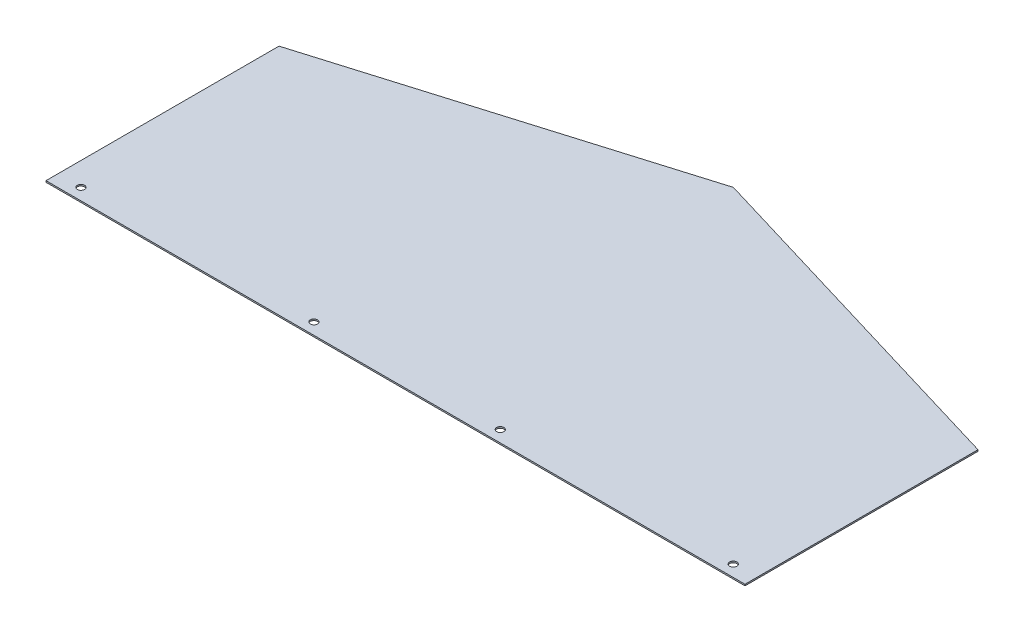
ISO-10303-21;
HEADER;
FILE_DESCRIPTION(('STEP AP214'),'2;1');
FILE_NAME('part.step','',(''),(''),'','','');
FILE_SCHEMA(('AUTOMOTIVE_DESIGN { 1 0 10303 214 1 1 1 1 }'));
ENDSEC;
DATA;
#1=APPLICATION_CONTEXT('core data for automotive mechanical design processes');
#2=APPLICATION_PROTOCOL_DEFINITION('international standard','automotive_design',2000,#1);
#3=PRODUCT_CONTEXT('',#1,'mechanical');
#4=PRODUCT('Part','Part','',(#3));
#5=PRODUCT_RELATED_PRODUCT_CATEGORY('part','',(#4));
#6=PRODUCT_DEFINITION_FORMATION('','',#4);
#7=PRODUCT_DEFINITION_CONTEXT('part definition',#1,'design');
#8=PRODUCT_DEFINITION('design','',#6,#7);
#9=PRODUCT_DEFINITION_SHAPE('','',#8);
#10=(LENGTH_UNIT() NAMED_UNIT(*) SI_UNIT(.MILLI.,.METRE.));
#11=(NAMED_UNIT(*) PLANE_ANGLE_UNIT() SI_UNIT($,.RADIAN.));
#12=(NAMED_UNIT(*) SI_UNIT($,.STERADIAN.) SOLID_ANGLE_UNIT());
#13=UNCERTAINTY_MEASURE_WITH_UNIT(LENGTH_MEASURE(1.E-05),#10,'distance_accuracy_value','');
#14=(GEOMETRIC_REPRESENTATION_CONTEXT(3) GLOBAL_UNCERTAINTY_ASSIGNED_CONTEXT((#13)) GLOBAL_UNIT_ASSIGNED_CONTEXT((#10,
#11,#12)) REPRESENTATION_CONTEXT('',''));
#15=CARTESIAN_POINT('',(0.,0.,0.));
#16=DIRECTION('',(0.,0.,1.));
#17=DIRECTION('',(1.,0.,0.));
#18=AXIS2_PLACEMENT_3D('',#15,#16,#17);
#19=CARTESIAN_POINT('',(0.,3.175,0.));
#20=DIRECTION('',(1.,0.,0.));
#21=DIRECTION('',(0.,0.,-1.));
#22=AXIS2_PLACEMENT_3D('',#19,#20,#21);
#23=PLANE('',#22);
#24=DIRECTION('',(0.,0.,1.));
#25=VECTOR('',#24,1.);
#26=CARTESIAN_POINT('',(0.,0.,0.));
#27=LINE('',#26,#25);
#28=CARTESIAN_POINT('',(-1.24424114793371E-13,0.,-508.));
#29=VERTEX_POINT('',#28);
#30=CARTESIAN_POINT('',(0.,0.,0.));
#31=VERTEX_POINT('',#30);
#32=EDGE_CURVE('E108',#29,#31,#27,.T.);
#33=ORIENTED_EDGE('',*,*,#32,.T.);
#34=DIRECTION('',(0.,-1.,0.));
#35=VECTOR('',#34,1.);
#36=CARTESIAN_POINT('',(0.,3.175,0.));
#37=LINE('',#36,#35);
#38=CARTESIAN_POINT('',(0.,3.175,0.));
#39=VERTEX_POINT('',#38);
#40=EDGE_CURVE('E11',#39,#31,#37,.T.);
#41=ORIENTED_EDGE('',*,*,#40,.F.);
#42=DIRECTION('',(0.,0.,1.));
#43=VECTOR('',#42,1.);
#44=CARTESIAN_POINT('',(0.,3.175,0.));
#45=LINE('',#44,#43);
#46=CARTESIAN_POINT('',(-1.24424114793371E-13,3.175,-508.));
#47=VERTEX_POINT('',#46);
#48=EDGE_CURVE('E117',#47,#39,#45,.T.);
#49=ORIENTED_EDGE('',*,*,#48,.F.);
#50=DIRECTION('',(0.,-1.,0.));
#51=VECTOR('',#50,1.);
#52=CARTESIAN_POINT('',(-1.24424114793371E-13,3.175,-508.));
#53=LINE('',#52,#51);
#54=EDGE_CURVE('E104',#47,#29,#53,.T.);
#55=ORIENTED_EDGE('',*,*,#54,.T.);
#56=EDGE_LOOP('',(#33,#41,#49,#55));
#57=FACE_BOUND('',#56,.T.);
#58=ADVANCED_FACE('F34',(#57),#23,.F.);
#59=CARTESIAN_POINT('',(0.,3.175,0.));
#60=DIRECTION('',(0.,0.,-1.));
#61=DIRECTION('',(-1.,0.,0.));
#62=AXIS2_PLACEMENT_3D('',#59,#60,#61);
#63=PLANE('',#62);
#64=DIRECTION('',(1.,0.,0.));
#65=VECTOR('',#64,1.);
#66=CARTESIAN_POINT('',(0.,0.,0.));
#67=LINE('',#66,#65);
#68=CARTESIAN_POINT('',(1524.,0.,0.));
#69=VERTEX_POINT('',#68);
#70=EDGE_CURVE('E111',#31,#69,#67,.T.);
#71=ORIENTED_EDGE('',*,*,#70,.T.);
#72=DIRECTION('',(0.,-1.,0.));
#73=VECTOR('',#72,1.);
#74=CARTESIAN_POINT('',(1524.,3.175,0.));
#75=LINE('',#74,#73);
#76=CARTESIAN_POINT('',(1524.,3.175,0.));
#77=VERTEX_POINT('',#76);
#78=EDGE_CURVE('E42',#77,#69,#75,.T.);
#79=ORIENTED_EDGE('',*,*,#78,.F.);
#80=DIRECTION('',(1.,0.,0.));
#81=VECTOR('',#80,1.);
#82=CARTESIAN_POINT('',(0.,3.175,0.));
#83=LINE('',#82,#81);
#84=EDGE_CURVE('E84',#39,#77,#83,.T.);
#85=ORIENTED_EDGE('',*,*,#84,.F.);
#86=ORIENTED_EDGE('',*,*,#40,.T.);
#87=EDGE_LOOP('',(#71,#79,#85,#86));
#88=FACE_BOUND('',#87,.T.);
#89=ADVANCED_FACE('F137',(#88),#63,.F.);
#90=CARTESIAN_POINT('',(1524.,3.175,0.));
#91=DIRECTION('',(-1.,0.,0.));
#92=DIRECTION('',(0.,0.,1.));
#93=AXIS2_PLACEMENT_3D('',#90,#91,#92);
#94=PLANE('',#93);
#95=DIRECTION('',(0.,0.,-1.));
#96=VECTOR('',#95,1.);
#97=CARTESIAN_POINT('',(1524.,0.,0.));
#98=LINE('',#97,#96);
#99=CARTESIAN_POINT('',(1524.,0.,-508.));
#100=VERTEX_POINT('',#99);
#101=EDGE_CURVE('E99',#69,#100,#98,.T.);
#102=ORIENTED_EDGE('',*,*,#101,.T.);
#103=DIRECTION('',(0.,-1.,0.));
#104=VECTOR('',#103,1.);
#105=CARTESIAN_POINT('',(1524.,3.175,-508.));
#106=LINE('',#105,#104);
#107=CARTESIAN_POINT('',(1524.,3.175,-508.));
#108=VERTEX_POINT('',#107);
#109=EDGE_CURVE('E96',#108,#100,#106,.T.);
#110=ORIENTED_EDGE('',*,*,#109,.F.);
#111=DIRECTION('',(0.,0.,-1.));
#112=VECTOR('',#111,1.);
#113=CARTESIAN_POINT('',(1524.,3.175,0.));
#114=LINE('',#113,#112);
#115=EDGE_CURVE('E88',#77,#108,#114,.T.);
#116=ORIENTED_EDGE('',*,*,#115,.F.);
#117=ORIENTED_EDGE('',*,*,#78,.T.);
#118=EDGE_LOOP('',(#102,#110,#116,#117));
#119=FACE_BOUND('',#118,.T.);
#120=ADVANCED_FACE('F97',(#119),#94,.F.);
#121=CARTESIAN_POINT('',(762.,3.175,-736.6));
#122=DIRECTION('',(-0.287347885566345,0.,0.957826285221151));
#123=DIRECTION('',(0.957826285221152,0.,0.287347885566345));
#124=AXIS2_PLACEMENT_3D('',#121,#122,#123);
#125=PLANE('',#124);
#126=DIRECTION('',(-0.957826285221151,0.,-0.287347885566345));
#127=VECTOR('',#126,1.);
#128=CARTESIAN_POINT('',(762.,0.,-736.6));
#129=LINE('',#128,#127);
#130=CARTESIAN_POINT('',(762.,0.,-736.6));
#131=VERTEX_POINT('',#130);
#132=EDGE_CURVE('E70',#100,#131,#129,.T.);
#133=ORIENTED_EDGE('',*,*,#132,.T.);
#134=DIRECTION('',(0.,-1.,0.));
#135=VECTOR('',#134,1.);
#136=CARTESIAN_POINT('',(762.,3.175,-736.6));
#137=LINE('',#136,#135);
#138=CARTESIAN_POINT('',(762.,3.175,-736.6));
#139=VERTEX_POINT('',#138);
#140=EDGE_CURVE('E100',#139,#131,#137,.T.);
#141=ORIENTED_EDGE('',*,*,#140,.F.);
#142=DIRECTION('',(-0.957826285221151,0.,-0.287347885566345));
#143=VECTOR('',#142,1.);
#144=CARTESIAN_POINT('',(762.,3.175,-736.6));
#145=LINE('',#144,#143);
#146=EDGE_CURVE('E92',#108,#139,#145,.T.);
#147=ORIENTED_EDGE('',*,*,#146,.F.);
#148=ORIENTED_EDGE('',*,*,#109,.T.);
#149=EDGE_LOOP('',(#133,#141,#147,#148));
#150=FACE_BOUND('',#149,.T.);
#151=ADVANCED_FACE('F102',(#150),#125,.F.);
#152=CARTESIAN_POINT('',(-1.24424114793371E-13,3.175,-508.));
#153=DIRECTION('',(0.287347885566345,0.,0.957826285221151));
#154=DIRECTION('',(0.957826285221152,0.,-0.287347885566345));
#155=AXIS2_PLACEMENT_3D('',#152,#153,#154);
#156=PLANE('',#155);
#157=DIRECTION('',(-0.957826285221151,0.,0.287347885566345));
#158=VECTOR('',#157,1.);
#159=CARTESIAN_POINT('',(-1.24424114793371E-13,0.,-508.));
#160=LINE('',#159,#158);
#161=EDGE_CURVE('E76',#131,#29,#160,.T.);
#162=ORIENTED_EDGE('',*,*,#161,.T.);
#163=ORIENTED_EDGE('',*,*,#54,.F.);
#164=DIRECTION('',(-0.957826285221151,0.,0.287347885566345));
#165=VECTOR('',#164,1.);
#166=CARTESIAN_POINT('',(-1.24424114793371E-13,3.175,-508.));
#167=LINE('',#166,#165);
#168=EDGE_CURVE('E50',#139,#47,#167,.T.);
#169=ORIENTED_EDGE('',*,*,#168,.F.);
#170=ORIENTED_EDGE('',*,*,#140,.T.);
#171=EDGE_LOOP('',(#162,#163,#169,#170));
#172=FACE_BOUND('',#171,.T.);
#173=ADVANCED_FACE('F125',(#172),#156,.F.);
#174=CARTESIAN_POINT('',(0.,3.175,0.));
#175=DIRECTION('',(0.,-1.,0.));
#176=DIRECTION('',(0.,0.,-1.));
#177=AXIS2_PLACEMENT_3D('',#174,#175,#176);
#178=PLANE('',#177);
#179=CARTESIAN_POINT('',(50.7999999999999,3.175,-25.4));
#180=DIRECTION('',(0.,-1.,0.));
#181=DIRECTION('',(0.,0.,-1.));
#182=AXIS2_PLACEMENT_3D('',#179,#180,#181);
#183=CIRCLE('',#182,7.93749999999999);
#184=CARTESIAN_POINT('',(50.7999999999999,3.175,-33.3375));
#185=VERTEX_POINT('',#184);
#186=EDGE_CURVE('E216',#185,#185,#183,.T.);
#187=ORIENTED_EDGE('',*,*,#186,.T.);
#188=EDGE_LOOP('',(#187));
#189=FACE_BOUND('',#188,.T.);
#190=CARTESIAN_POINT('',(558.8,3.175,-25.3259602988576));
#191=DIRECTION('',(0.,-1.,0.));
#192=DIRECTION('',(0.,0.,-1.));
#193=AXIS2_PLACEMENT_3D('',#190,#191,#192);
#194=CIRCLE('',#193,7.93750000000004);
#195=CARTESIAN_POINT('',(558.8,3.175,-33.2634602988576));
#196=VERTEX_POINT('',#195);
#197=EDGE_CURVE('E226',#196,#196,#194,.T.);
#198=ORIENTED_EDGE('',*,*,#197,.T.);
#199=EDGE_LOOP('',(#198));
#200=FACE_BOUND('',#199,.T.);
#201=CARTESIAN_POINT('',(965.2,3.175,-25.2667285379436));
#202=DIRECTION('',(0.,-1.,0.));
#203=DIRECTION('',(0.,0.,-1.));
#204=AXIS2_PLACEMENT_3D('',#201,#202,#203);
#205=CIRCLE('',#204,7.93750000000004);
#206=CARTESIAN_POINT('',(965.2,3.175,-33.2042285379437));
#207=VERTEX_POINT('',#206);
#208=EDGE_CURVE('E232',#207,#207,#205,.T.);
#209=ORIENTED_EDGE('',*,*,#208,.T.);
#210=EDGE_LOOP('',(#209));
#211=FACE_BOUND('',#210,.T.);
#212=CARTESIAN_POINT('',(1473.2,3.175,-25.1926888368012));
#213=DIRECTION('',(0.,-1.,0.));
#214=DIRECTION('',(0.,0.,-1.));
#215=AXIS2_PLACEMENT_3D('',#212,#213,#214);
#216=CIRCLE('',#215,7.93749999999993);
#217=CARTESIAN_POINT('',(1473.2,3.175,-33.1301888368011));
#218=VERTEX_POINT('',#217);
#219=EDGE_CURVE('E112',#218,#218,#216,.T.);
#220=ORIENTED_EDGE('',*,*,#219,.T.);
#221=EDGE_LOOP('',(#220));
#222=FACE_BOUND('',#221,.T.);
#223=ORIENTED_EDGE('',*,*,#48,.T.);
#224=ORIENTED_EDGE('',*,*,#84,.T.);
#225=ORIENTED_EDGE('',*,*,#115,.T.);
#226=ORIENTED_EDGE('',*,*,#146,.T.);
#227=ORIENTED_EDGE('',*,*,#168,.T.);
#228=EDGE_LOOP('',(#223,#224,#225,#226,#227));
#229=FACE_BOUND('',#228,.T.);
#230=ADVANCED_FACE('F90',(#189,#200,#211,#222,#229),#178,.F.);
#231=CARTESIAN_POINT('',(0.,0.,0.));
#232=DIRECTION('',(0.,-1.,0.));
#233=DIRECTION('',(0.,0.,-1.));
#234=AXIS2_PLACEMENT_3D('',#231,#232,#233);
#235=PLANE('',#234);
#236=CARTESIAN_POINT('',(50.7999999999999,0.,-25.4));
#237=DIRECTION('',(0.,-1.,0.));
#238=DIRECTION('',(0.,0.,-1.));
#239=AXIS2_PLACEMENT_3D('',#236,#237,#238);
#240=CIRCLE('',#239,7.93749999999999);
#241=CARTESIAN_POINT('',(50.7999999999999,0.,-33.3375));
#242=VERTEX_POINT('',#241);
#243=EDGE_CURVE('E219',#242,#242,#240,.T.);
#244=ORIENTED_EDGE('',*,*,#243,.F.);
#245=EDGE_LOOP('',(#244));
#246=FACE_BOUND('',#245,.T.);
#247=CARTESIAN_POINT('',(558.8,0.,-25.3259602988576));
#248=DIRECTION('',(0.,-1.,0.));
#249=DIRECTION('',(0.,0.,-1.));
#250=AXIS2_PLACEMENT_3D('',#247,#248,#249);
#251=CIRCLE('',#250,7.93750000000004);
#252=CARTESIAN_POINT('',(558.8,0.,-33.2634602988576));
#253=VERTEX_POINT('',#252);
#254=EDGE_CURVE('E221',#253,#253,#251,.T.);
#255=ORIENTED_EDGE('',*,*,#254,.F.);
#256=EDGE_LOOP('',(#255));
#257=FACE_BOUND('',#256,.T.);
#258=CARTESIAN_POINT('',(965.2,0.,-25.2667285379436));
#259=DIRECTION('',(0.,-1.,0.));
#260=DIRECTION('',(0.,0.,-1.));
#261=AXIS2_PLACEMENT_3D('',#258,#259,#260);
#262=CIRCLE('',#261,7.93750000000004);
#263=CARTESIAN_POINT('',(965.2,0.,-33.2042285379437));
#264=VERTEX_POINT('',#263);
#265=EDGE_CURVE('E229',#264,#264,#262,.T.);
#266=ORIENTED_EDGE('',*,*,#265,.F.);
#267=EDGE_LOOP('',(#266));
#268=FACE_BOUND('',#267,.T.);
#269=CARTESIAN_POINT('',(1473.2,0.,-25.1926888368012));
#270=DIRECTION('',(0.,-1.,0.));
#271=DIRECTION('',(0.,0.,-1.));
#272=AXIS2_PLACEMENT_3D('',#269,#270,#271);
#273=CIRCLE('',#272,7.93749999999993);
#274=CARTESIAN_POINT('',(1473.2,0.,-33.1301888368011));
#275=VERTEX_POINT('',#274);
#276=EDGE_CURVE('E235',#275,#275,#273,.T.);
#277=ORIENTED_EDGE('',*,*,#276,.F.);
#278=EDGE_LOOP('',(#277));
#279=FACE_BOUND('',#278,.T.);
#280=ORIENTED_EDGE('',*,*,#32,.F.);
#281=ORIENTED_EDGE('',*,*,#161,.F.);
#282=ORIENTED_EDGE('',*,*,#132,.F.);
#283=ORIENTED_EDGE('',*,*,#101,.F.);
#284=ORIENTED_EDGE('',*,*,#70,.F.);
#285=EDGE_LOOP('',(#280,#281,#282,#283,#284));
#286=FACE_BOUND('',#285,.T.);
#287=ADVANCED_FACE('F121',(#246,#257,#268,#279,#286),#235,.T.);
#288=CARTESIAN_POINT('',(1473.2,0.,-25.1926888368012));
#289=DIRECTION('',(0.,-1.,0.));
#290=DIRECTION('',(0.,0.,-1.));
#291=AXIS2_PLACEMENT_3D('',#288,#289,#290);
#292=CYLINDRICAL_SURFACE('',#291,7.93749999999993);
#293=ORIENTED_EDGE('',*,*,#219,.F.);
#294=EDGE_LOOP('',(#293));
#295=FACE_BOUND('',#294,.T.);
#296=ORIENTED_EDGE('',*,*,#276,.T.);
#297=EDGE_LOOP('',(#296));
#298=FACE_BOUND('',#297,.T.);
#299=ADVANCED_FACE('F170',(#295,#298),#292,.F.);
#300=CARTESIAN_POINT('',(965.2,0.,-25.2667285379436));
#301=DIRECTION('',(0.,-1.,0.));
#302=DIRECTION('',(0.,0.,-1.));
#303=AXIS2_PLACEMENT_3D('',#300,#301,#302);
#304=CYLINDRICAL_SURFACE('',#303,7.93750000000004);
#305=ORIENTED_EDGE('',*,*,#208,.F.);
#306=EDGE_LOOP('',(#305));
#307=FACE_BOUND('',#306,.T.);
#308=ORIENTED_EDGE('',*,*,#265,.T.);
#309=EDGE_LOOP('',(#308));
#310=FACE_BOUND('',#309,.T.);
#311=ADVANCED_FACE('F179',(#307,#310),#304,.F.);
#312=CARTESIAN_POINT('',(558.8,0.,-25.3259602988576));
#313=DIRECTION('',(0.,-1.,0.));
#314=DIRECTION('',(0.,0.,-1.));
#315=AXIS2_PLACEMENT_3D('',#312,#313,#314);
#316=CYLINDRICAL_SURFACE('',#315,7.93750000000004);
#317=ORIENTED_EDGE('',*,*,#197,.F.);
#318=EDGE_LOOP('',(#317));
#319=FACE_BOUND('',#318,.T.);
#320=ORIENTED_EDGE('',*,*,#254,.T.);
#321=EDGE_LOOP('',(#320));
#322=FACE_BOUND('',#321,.T.);
#323=ADVANCED_FACE('F189',(#319,#322),#316,.F.);
#324=CARTESIAN_POINT('',(50.7999999999999,0.,-25.4));
#325=DIRECTION('',(0.,-1.,0.));
#326=DIRECTION('',(0.,0.,-1.));
#327=AXIS2_PLACEMENT_3D('',#324,#325,#326);
#328=CYLINDRICAL_SURFACE('',#327,7.93749999999999);
#329=ORIENTED_EDGE('',*,*,#186,.F.);
#330=EDGE_LOOP('',(#329));
#331=FACE_BOUND('',#330,.T.);
#332=ORIENTED_EDGE('',*,*,#243,.T.);
#333=EDGE_LOOP('',(#332));
#334=FACE_BOUND('',#333,.T.);
#335=ADVANCED_FACE('F199',(#331,#334),#328,.F.);
#336=CLOSED_SHELL('',(#58,#89,#120,#151,#173,#230,#287,#299,#311,#323,#335));
#337=MANIFOLD_SOLID_BREP('B2',#336);
#338=ADVANCED_BREP_SHAPE_REPRESENTATION('',(#18,#337),#14);
#339=SHAPE_DEFINITION_REPRESENTATION(#9,#338);
ENDSEC;
END-ISO-10303-21;
